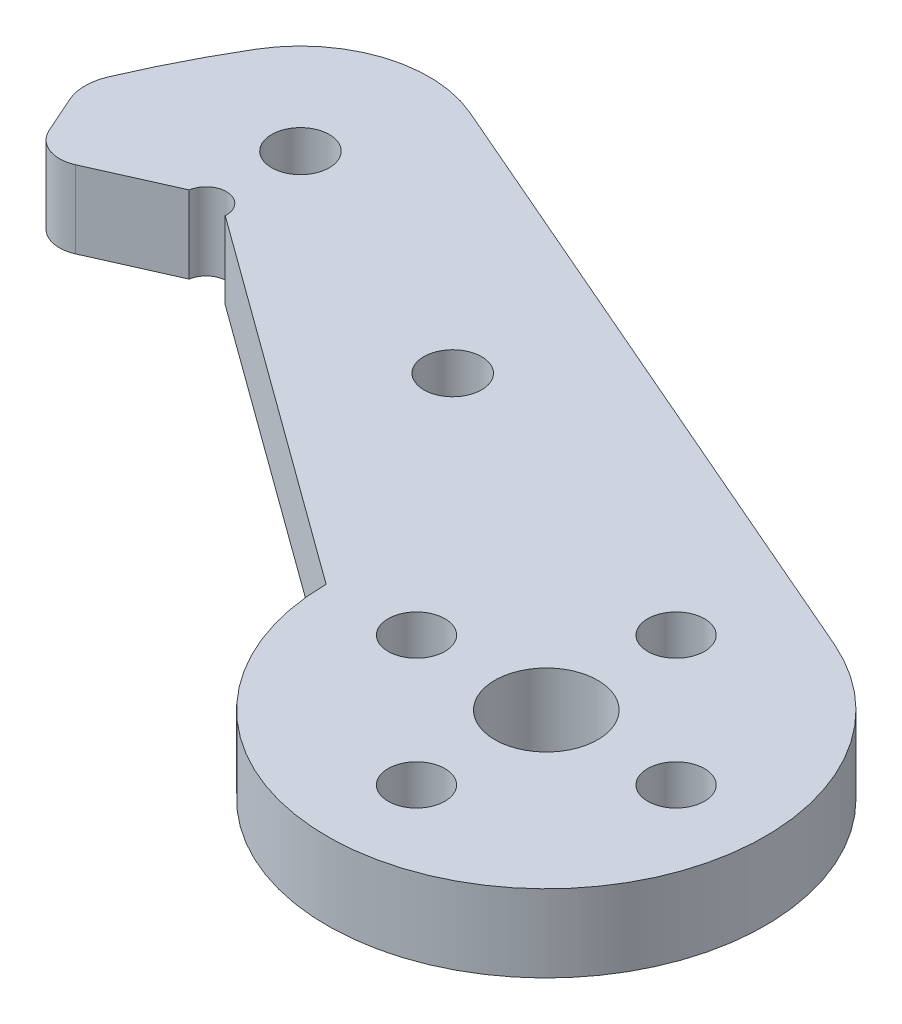
ISO-10303-21;
HEADER;
FILE_DESCRIPTION(('STEP AP214'),'2;1');
FILE_NAME('part.step','',(''),(''),'','','');
FILE_SCHEMA(('AUTOMOTIVE_DESIGN { 1 0 10303 214 1 1 1 1 }'));
ENDSEC;
DATA;
#1=APPLICATION_CONTEXT('core data for automotive mechanical design processes');
#2=APPLICATION_PROTOCOL_DEFINITION('international standard','automotive_design',2000,#1);
#3=PRODUCT_CONTEXT('',#1,'mechanical');
#4=PRODUCT('Part','Part','',(#3));
#5=PRODUCT_RELATED_PRODUCT_CATEGORY('part','',(#4));
#6=PRODUCT_DEFINITION_FORMATION('','',#4);
#7=PRODUCT_DEFINITION_CONTEXT('part definition',#1,'design');
#8=PRODUCT_DEFINITION('design','',#6,#7);
#9=PRODUCT_DEFINITION_SHAPE('','',#8);
#10=(LENGTH_UNIT() NAMED_UNIT(*) SI_UNIT(.MILLI.,.METRE.));
#11=(NAMED_UNIT(*) PLANE_ANGLE_UNIT() SI_UNIT($,.RADIAN.));
#12=(NAMED_UNIT(*) SI_UNIT($,.STERADIAN.) SOLID_ANGLE_UNIT());
#13=UNCERTAINTY_MEASURE_WITH_UNIT(LENGTH_MEASURE(1.E-05),#10,'distance_accuracy_value','');
#14=(GEOMETRIC_REPRESENTATION_CONTEXT(3) GLOBAL_UNCERTAINTY_ASSIGNED_CONTEXT((#13)) GLOBAL_UNIT_ASSIGNED_CONTEXT((#10,
#11,#12)) REPRESENTATION_CONTEXT('',''));
#15=CARTESIAN_POINT('',(0.,0.,0.));
#16=DIRECTION('',(0.,0.,1.));
#17=DIRECTION('',(1.,0.,0.));
#18=AXIS2_PLACEMENT_3D('',#15,#16,#17);
#19=CARTESIAN_POINT('',(-44.4381463641511,4.7625,-16.4261833639371));
#20=DIRECTION('',(0.,-1.,0.));
#21=DIRECTION('',(0.,0.,-1.));
#22=AXIS2_PLACEMENT_3D('',#19,#20,#21);
#23=PLANE('',#22);
#24=CARTESIAN_POINT('',(-44.4381463641511,4.7625,-16.4261833639371));
#25=DIRECTION('',(0.,1.,0.));
#26=DIRECTION('',(0.,0.,-1.));
#27=AXIS2_PLACEMENT_3D('',#24,#25,#26);
#28=CIRCLE('',#27,2.);
#29=CARTESIAN_POINT('',(-46.2655823530906,4.7625,-15.6134855687334));
#30=VERTEX_POINT('',#29);
#31=CARTESIAN_POINT('',(-43.6254485689475,4.7625,-14.5987473749976));
#32=VERTEX_POINT('',#31);
#33=EDGE_CURVE('E171',#30,#32,#28,.T.);
#34=ORIENTED_EDGE('',*,*,#33,.T.);
#35=DIRECTION('',(0.913717994469729,0.,-0.406348897601823));
#36=VECTOR('',#35,1.);
#37=CARTESIAN_POINT('',(-38.7702250311405,4.7625,-16.7579636147339));
#38=LINE('',#37,#36);
#39=CARTESIAN_POINT('',(-38.7702250311405,4.7625,-16.7579636147339));
#40=VERTEX_POINT('',#39);
#41=EDGE_CURVE('E109',#32,#40,#38,.T.);
#42=ORIENTED_EDGE('',*,*,#41,.T.);
#43=CARTESIAN_POINT('',(-37.5347907026087,4.7625,-16.5676953307629));
#44=DIRECTION('',(0.,-1.,0.));
#45=DIRECTION('',(0.,0.,-1.));
#46=AXIS2_PLACEMENT_3D('',#43,#44,#45);
#47=CIRCLE('',#46,1.25);
#48=CARTESIAN_POINT('',(-36.2868550805044,4.7625,-16.4958852821415));
#49=VERTEX_POINT('',#48);
#50=EDGE_CURVE('E192',#40,#49,#47,.T.);
#51=ORIENTED_EDGE('',*,*,#50,.T.);
#52=DIRECTION('',(0.808767465357848,0.,0.588128546304839));
#53=VECTOR('',#52,1.);
#54=CARTESIAN_POINT('',(-36.2868550805044,4.7625,-16.4958852821415));
#55=LINE('',#54,#53);
#56=CARTESIAN_POINT('',(-13.4997935259034,4.7625,0.0746643018933128));
#57=VERTEX_POINT('',#56);
#58=EDGE_CURVE('E211',#49,#57,#55,.T.);
#59=ORIENTED_EDGE('',*,*,#58,.T.);
#60=CARTESIAN_POINT('',(0.,4.7625,0.));
#61=DIRECTION('',(0.,1.,0.));
#62=DIRECTION('',(0.,0.,1.));
#63=AXIS2_PLACEMENT_3D('',#60,#61,#62);
#64=CIRCLE('',#63,13.5);
#65=CARTESIAN_POINT('',(5.36363887672502,4.7625,-12.3887601478148));
#66=VERTEX_POINT('',#65);
#67=EDGE_CURVE('E208',#57,#66,#64,.T.);
#68=ORIENTED_EDGE('',*,*,#67,.T.);
#69=DIRECTION('',(-0.91768593687517,0.,-0.397306583461113));
#70=VECTOR('',#69,1.);
#71=CARTESIAN_POINT('',(-34.2596328863461,4.7625,-29.5434163293646));
#72=LINE('',#71,#70);
#73=CARTESIAN_POINT('',(-34.2596328863461,4.7625,-29.5434163293646));
#74=VERTEX_POINT('',#73);
#75=EDGE_CURVE('E210',#66,#74,#72,.T.);
#76=ORIENTED_EDGE('',*,*,#75,.T.);
#77=CARTESIAN_POINT('',(-37.4132538925687,4.7625,-22.2592842054179));
#78=DIRECTION('',(0.,1.,0.));
#79=DIRECTION('',(0.,0.,1.));
#80=AXIS2_PLACEMENT_3D('',#77,#78,#79);
#81=CIRCLE('',#80,7.93750000000001);
#82=CARTESIAN_POINT('',(-44.234733224639,4.7625,-26.3177723441387));
#83=VERTEX_POINT('',#82);
#84=EDGE_CURVE('E134',#74,#83,#81,.T.);
#85=ORIENTED_EDGE('',*,*,#84,.T.);
#86=CARTESIAN_POINT('',(0.,4.7625,0.));
#87=DIRECTION('',(0.,1.,0.));
#88=DIRECTION('',(0.,0.,-1.));
#89=AXIS2_PLACEMENT_3D('',#86,#87,#88);
#90=CIRCLE('',#89,51.4717083902691);
#91=CARTESIAN_POINT('',(-47.2982832858306,4.7625,-20.3029348328316));
#92=VERTEX_POINT('',#91);
#93=EDGE_CURVE('E128',#83,#92,#90,.T.);
#94=ORIENTED_EDGE('',*,*,#93,.T.);
#95=CARTESIAN_POINT('',(-44.5415290553004,4.7625,-19.1195895271606));
#96=DIRECTION('',(0.,1.,0.));
#97=DIRECTION('',(0.,0.,1.));
#98=AXIS2_PLACEMENT_3D('',#95,#96,#97);
#99=CIRCLE('',#98,3.);
#100=CARTESIAN_POINT('',(-47.2826830387096,4.7625,-17.9005428343551));
#101=VERTEX_POINT('',#100);
#102=EDGE_CURVE('E132',#92,#101,#99,.T.);
#103=ORIENTED_EDGE('',*,*,#102,.T.);
#104=DIRECTION('',(0.406348897601823,0.,0.913717994469729));
#105=VECTOR('',#104,1.);
#106=CARTESIAN_POINT('',(-46.2655823530906,4.7625,-15.6134855687334));
#107=LINE('',#106,#105);
#108=EDGE_CURVE('E60',#101,#30,#107,.T.);
#109=ORIENTED_EDGE('',*,*,#108,.T.);
#110=EDGE_LOOP('',(#34,#42,#51,#59,#68,#76,#85,#94,#103,#109));
#111=FACE_BOUND('',#110,.T.);
#112=CARTESIAN_POINT('',(-20.8624589223986,4.7625,-15.0937174914343));
#113=DIRECTION('',(0.,1.,0.));
#114=DIRECTION('',(0.,0.,1.));
#115=AXIS2_PLACEMENT_3D('',#112,#113,#114);
#116=CIRCLE('',#115,1.778);
#117=CARTESIAN_POINT('',(-20.8624589223986,4.7625,-13.3157174914343));
#118=VERTEX_POINT('',#117);
#119=EDGE_CURVE('E156',#118,#118,#116,.T.);
#120=ORIENTED_EDGE('',*,*,#119,.F.);
#121=EDGE_LOOP('',(#120));
#122=FACE_BOUND('',#121,.T.);
#123=CARTESIAN_POINT('',(8.,4.7625,0.));
#124=DIRECTION('',(0.,1.,0.));
#125=DIRECTION('',(0.,0.,1.));
#126=AXIS2_PLACEMENT_3D('',#123,#124,#125);
#127=CIRCLE('',#126,1.75);
#128=CARTESIAN_POINT('',(8.,4.7625,1.75));
#129=VERTEX_POINT('',#128);
#130=EDGE_CURVE('E222',#129,#129,#127,.T.);
#131=ORIENTED_EDGE('',*,*,#130,.F.);
#132=EDGE_LOOP('',(#131));
#133=FACE_BOUND('',#132,.T.);
#134=CARTESIAN_POINT('',(0.,4.7625,8.));
#135=DIRECTION('',(0.,1.,0.));
#136=DIRECTION('',(0.,0.,1.));
#137=AXIS2_PLACEMENT_3D('',#134,#135,#136);
#138=CIRCLE('',#137,1.75);
#139=CARTESIAN_POINT('',(0.,4.7625,9.75));
#140=VERTEX_POINT('',#139);
#141=EDGE_CURVE('E228',#140,#140,#138,.T.);
#142=ORIENTED_EDGE('',*,*,#141,.F.);
#143=EDGE_LOOP('',(#142));
#144=FACE_BOUND('',#143,.T.);
#145=CARTESIAN_POINT('',(-8.,4.7625,0.));
#146=DIRECTION('',(0.,1.,0.));
#147=DIRECTION('',(0.,0.,1.));
#148=AXIS2_PLACEMENT_3D('',#145,#146,#147);
#149=CIRCLE('',#148,1.75);
#150=CARTESIAN_POINT('',(-8.,4.7625,1.75));
#151=VERTEX_POINT('',#150);
#152=EDGE_CURVE('E234',#151,#151,#149,.T.);
#153=ORIENTED_EDGE('',*,*,#152,.F.);
#154=EDGE_LOOP('',(#153));
#155=FACE_BOUND('',#154,.T.);
#156=CARTESIAN_POINT('',(0.,4.7625,-8.));
#157=DIRECTION('',(0.,1.,0.));
#158=DIRECTION('',(0.,0.,1.));
#159=AXIS2_PLACEMENT_3D('',#156,#157,#158);
#160=CIRCLE('',#159,1.75);
#161=CARTESIAN_POINT('',(0.,4.7625,-6.25));
#162=VERTEX_POINT('',#161);
#163=EDGE_CURVE('E240',#162,#162,#160,.T.);
#164=ORIENTED_EDGE('',*,*,#163,.F.);
#165=EDGE_LOOP('',(#164));
#166=FACE_BOUND('',#165,.T.);
#167=CARTESIAN_POINT('',(0.,4.7625,0.));
#168=DIRECTION('',(0.,1.,0.));
#169=DIRECTION('',(0.,0.,1.));
#170=AXIS2_PLACEMENT_3D('',#167,#168,#169);
#171=CIRCLE('',#170,3.175);
#172=CARTESIAN_POINT('',(0.,4.7625,3.175));
#173=VERTEX_POINT('',#172);
#174=EDGE_CURVE('E246',#173,#173,#171,.T.);
#175=ORIENTED_EDGE('',*,*,#174,.F.);
#176=EDGE_LOOP('',(#175));
#177=FACE_BOUND('',#176,.T.);
#178=CARTESIAN_POINT('',(-37.4132538925687,4.7625,-22.2592842054179));
#179=DIRECTION('',(0.,1.,0.));
#180=DIRECTION('',(0.,0.,1.));
#181=AXIS2_PLACEMENT_3D('',#178,#179,#180);
#182=CIRCLE('',#181,1.778);
#183=CARTESIAN_POINT('',(-37.4132538925687,4.7625,-20.4812842054179));
#184=VERTEX_POINT('',#183);
#185=EDGE_CURVE('E252',#184,#184,#182,.T.);
#186=ORIENTED_EDGE('',*,*,#185,.F.);
#187=EDGE_LOOP('',(#186));
#188=FACE_BOUND('',#187,.T.);
#189=ADVANCED_FACE('F43',(#111,#122,#133,#144,#155,#166,#177,#188),#23,.F.);
#190=CARTESIAN_POINT('',(-44.4381463641511,0.,-16.4261833639371));
#191=DIRECTION('',(0.,-1.,0.));
#192=DIRECTION('',(0.,0.,-1.));
#193=AXIS2_PLACEMENT_3D('',#190,#191,#192);
#194=PLANE('',#193);
#195=CARTESIAN_POINT('',(0.,0.,0.));
#196=DIRECTION('',(0.,1.,0.));
#197=DIRECTION('',(0.,0.,1.));
#198=AXIS2_PLACEMENT_3D('',#195,#196,#197);
#199=CIRCLE('',#198,3.175);
#200=CARTESIAN_POINT('',(0.,0.,3.175));
#201=VERTEX_POINT('',#200);
#202=EDGE_CURVE('E249',#201,#201,#199,.T.);
#203=ORIENTED_EDGE('',*,*,#202,.T.);
#204=EDGE_LOOP('',(#203));
#205=FACE_BOUND('',#204,.T.);
#206=CARTESIAN_POINT('',(-8.,0.,0.));
#207=DIRECTION('',(0.,1.,0.));
#208=DIRECTION('',(0.,0.,1.));
#209=AXIS2_PLACEMENT_3D('',#206,#207,#208);
#210=CIRCLE('',#209,1.75);
#211=CARTESIAN_POINT('',(-8.,0.,1.75));
#212=VERTEX_POINT('',#211);
#213=EDGE_CURVE('E237',#212,#212,#210,.T.);
#214=ORIENTED_EDGE('',*,*,#213,.T.);
#215=EDGE_LOOP('',(#214));
#216=FACE_BOUND('',#215,.T.);
#217=CARTESIAN_POINT('',(8.,0.,0.));
#218=DIRECTION('',(0.,1.,0.));
#219=DIRECTION('',(0.,0.,1.));
#220=AXIS2_PLACEMENT_3D('',#217,#218,#219);
#221=CIRCLE('',#220,1.75);
#222=CARTESIAN_POINT('',(8.,0.,1.75));
#223=VERTEX_POINT('',#222);
#224=EDGE_CURVE('E225',#223,#223,#221,.T.);
#225=ORIENTED_EDGE('',*,*,#224,.T.);
#226=EDGE_LOOP('',(#225));
#227=FACE_BOUND('',#226,.T.);
#228=CARTESIAN_POINT('',(-44.4381463641511,0.,-16.4261833639371));
#229=DIRECTION('',(0.,1.,0.));
#230=DIRECTION('',(0.,0.,-1.));
#231=AXIS2_PLACEMENT_3D('',#228,#229,#230);
#232=CIRCLE('',#231,2.);
#233=CARTESIAN_POINT('',(-46.2655823530906,0.,-15.6134855687334));
#234=VERTEX_POINT('',#233);
#235=CARTESIAN_POINT('',(-43.6254485689475,0.,-14.5987473749976));
#236=VERTEX_POINT('',#235);
#237=EDGE_CURVE('E152',#234,#236,#232,.T.);
#238=ORIENTED_EDGE('',*,*,#237,.F.);
#239=DIRECTION('',(0.406348897601823,0.,0.913717994469729));
#240=VECTOR('',#239,1.);
#241=CARTESIAN_POINT('',(-46.2655823530906,0.,-15.6134855687334));
#242=LINE('',#241,#240);
#243=CARTESIAN_POINT('',(-47.2826830387096,0.,-17.9005428343551));
#244=VERTEX_POINT('',#243);
#245=EDGE_CURVE('E101',#244,#234,#242,.T.);
#246=ORIENTED_EDGE('',*,*,#245,.F.);
#247=CARTESIAN_POINT('',(-44.5415290553004,0.,-19.1195895271606));
#248=DIRECTION('',(0.,1.,0.));
#249=DIRECTION('',(0.,0.,1.));
#250=AXIS2_PLACEMENT_3D('',#247,#248,#249);
#251=CIRCLE('',#250,3.);
#252=CARTESIAN_POINT('',(-47.2982832858306,0.,-20.3029348328316));
#253=VERTEX_POINT('',#252);
#254=EDGE_CURVE('E95',#253,#244,#251,.T.);
#255=ORIENTED_EDGE('',*,*,#254,.F.);
#256=CARTESIAN_POINT('',(0.,0.,0.));
#257=DIRECTION('',(0.,1.,0.));
#258=DIRECTION('',(0.,0.,-1.));
#259=AXIS2_PLACEMENT_3D('',#256,#257,#258);
#260=CIRCLE('',#259,51.4717083902691);
#261=CARTESIAN_POINT('',(-44.234733224639,0.,-26.3177723441387));
#262=VERTEX_POINT('',#261);
#263=EDGE_CURVE('E142',#262,#253,#260,.T.);
#264=ORIENTED_EDGE('',*,*,#263,.F.);
#265=CARTESIAN_POINT('',(-37.4132538925687,0.,-22.2592842054179));
#266=DIRECTION('',(0.,1.,0.));
#267=DIRECTION('',(0.,0.,1.));
#268=AXIS2_PLACEMENT_3D('',#265,#266,#267);
#269=CIRCLE('',#268,7.93750000000001);
#270=CARTESIAN_POINT('',(-34.2596328863461,0.,-29.5434163293646));
#271=VERTEX_POINT('',#270);
#272=EDGE_CURVE('E166',#271,#262,#269,.T.);
#273=ORIENTED_EDGE('',*,*,#272,.F.);
#274=DIRECTION('',(-0.91768593687517,0.,-0.397306583461113));
#275=VECTOR('',#274,1.);
#276=CARTESIAN_POINT('',(-34.2596328863461,0.,-29.5434163293646));
#277=LINE('',#276,#275);
#278=CARTESIAN_POINT('',(5.36363887672502,0.,-12.3887601478148));
#279=VERTEX_POINT('',#278);
#280=EDGE_CURVE('E164',#279,#271,#277,.T.);
#281=ORIENTED_EDGE('',*,*,#280,.F.);
#282=CARTESIAN_POINT('',(0.,0.,0.));
#283=DIRECTION('',(0.,1.,0.));
#284=DIRECTION('',(0.,0.,1.));
#285=AXIS2_PLACEMENT_3D('',#282,#283,#284);
#286=CIRCLE('',#285,13.5);
#287=CARTESIAN_POINT('',(-13.4997935259034,0.,0.0746643018933128));
#288=VERTEX_POINT('',#287);
#289=EDGE_CURVE('E162',#288,#279,#286,.T.);
#290=ORIENTED_EDGE('',*,*,#289,.F.);
#291=DIRECTION('',(0.808767465357848,0.,0.588128546304839));
#292=VECTOR('',#291,1.);
#293=CARTESIAN_POINT('',(-36.2868550805044,0.,-16.4958852821415));
#294=LINE('',#293,#292);
#295=CARTESIAN_POINT('',(-36.2868550805044,0.,-16.4958852821415));
#296=VERTEX_POINT('',#295);
#297=EDGE_CURVE('E160',#296,#288,#294,.T.);
#298=ORIENTED_EDGE('',*,*,#297,.F.);
#299=CARTESIAN_POINT('',(-37.5347907026087,0.,-16.5676953307629));
#300=DIRECTION('',(0.,-1.,0.));
#301=DIRECTION('',(0.,0.,-1.));
#302=AXIS2_PLACEMENT_3D('',#299,#300,#301);
#303=CIRCLE('',#302,1.25);
#304=CARTESIAN_POINT('',(-38.7702250311405,0.,-16.7579636147339));
#305=VERTEX_POINT('',#304);
#306=EDGE_CURVE('E158',#305,#296,#303,.T.);
#307=ORIENTED_EDGE('',*,*,#306,.F.);
#308=DIRECTION('',(0.913717994469729,0.,-0.406348897601823));
#309=VECTOR('',#308,1.);
#310=CARTESIAN_POINT('',(-38.7702250311405,0.,-16.7579636147339));
#311=LINE('',#310,#309);
#312=EDGE_CURVE('E155',#236,#305,#311,.T.);
#313=ORIENTED_EDGE('',*,*,#312,.F.);
#314=EDGE_LOOP('',(#238,#246,#255,#264,#273,#281,#290,#298,#307,#313));
#315=FACE_BOUND('',#314,.T.);
#316=CARTESIAN_POINT('',(-20.8624589223986,0.,-15.0937174914343));
#317=DIRECTION('',(0.,1.,0.));
#318=DIRECTION('',(0.,0.,1.));
#319=AXIS2_PLACEMENT_3D('',#316,#317,#318);
#320=CIRCLE('',#319,1.778);
#321=CARTESIAN_POINT('',(-20.8624589223986,0.,-13.3157174914343));
#322=VERTEX_POINT('',#321);
#323=EDGE_CURVE('E219',#322,#322,#320,.T.);
#324=ORIENTED_EDGE('',*,*,#323,.T.);
#325=EDGE_LOOP('',(#324));
#326=FACE_BOUND('',#325,.T.);
#327=CARTESIAN_POINT('',(0.,0.,8.));
#328=DIRECTION('',(0.,1.,0.));
#329=DIRECTION('',(0.,0.,1.));
#330=AXIS2_PLACEMENT_3D('',#327,#328,#329);
#331=CIRCLE('',#330,1.75);
#332=CARTESIAN_POINT('',(0.,0.,9.75));
#333=VERTEX_POINT('',#332);
#334=EDGE_CURVE('E231',#333,#333,#331,.T.);
#335=ORIENTED_EDGE('',*,*,#334,.T.);
#336=EDGE_LOOP('',(#335));
#337=FACE_BOUND('',#336,.T.);
#338=CARTESIAN_POINT('',(0.,0.,-8.));
#339=DIRECTION('',(0.,1.,0.));
#340=DIRECTION('',(0.,0.,1.));
#341=AXIS2_PLACEMENT_3D('',#338,#339,#340);
#342=CIRCLE('',#341,1.75);
#343=CARTESIAN_POINT('',(0.,0.,-6.25));
#344=VERTEX_POINT('',#343);
#345=EDGE_CURVE('E243',#344,#344,#342,.T.);
#346=ORIENTED_EDGE('',*,*,#345,.T.);
#347=EDGE_LOOP('',(#346));
#348=FACE_BOUND('',#347,.T.);
#349=CARTESIAN_POINT('',(-37.4132538925687,0.,-22.2592842054179));
#350=DIRECTION('',(0.,1.,0.));
#351=DIRECTION('',(0.,0.,1.));
#352=AXIS2_PLACEMENT_3D('',#349,#350,#351);
#353=CIRCLE('',#352,1.778);
#354=CARTESIAN_POINT('',(-37.4132538925687,0.,-20.4812842054179));
#355=VERTEX_POINT('',#354);
#356=EDGE_CURVE('E255',#355,#355,#353,.T.);
#357=ORIENTED_EDGE('',*,*,#356,.T.);
#358=EDGE_LOOP('',(#357));
#359=FACE_BOUND('',#358,.T.);
#360=ADVANCED_FACE('F196',(#205,#216,#227,#315,#326,#337,#348,#359),#194,.T.);
#361=CARTESIAN_POINT('',(-44.4381463641511,4.7625,-16.4261833639371));
#362=DIRECTION('',(0.,-1.,0.));
#363=DIRECTION('',(0.,0.,-1.));
#364=AXIS2_PLACEMENT_3D('',#361,#362,#363);
#365=CYLINDRICAL_SURFACE('',#364,2.);
#366=ORIENTED_EDGE('',*,*,#237,.T.);
#367=DIRECTION('',(0.,-1.,0.));
#368=VECTOR('',#367,1.);
#369=CARTESIAN_POINT('',(-43.6254485689475,4.7625,-14.5987473749976));
#370=LINE('',#369,#368);
#371=EDGE_CURVE('E13',#32,#236,#370,.T.);
#372=ORIENTED_EDGE('',*,*,#371,.F.);
#373=ORIENTED_EDGE('',*,*,#33,.F.);
#374=DIRECTION('',(0.,-1.,0.));
#375=VECTOR('',#374,1.);
#376=CARTESIAN_POINT('',(-46.2655823530906,4.7625,-15.6134855687334));
#377=LINE('',#376,#375);
#378=EDGE_CURVE('E148',#30,#234,#377,.T.);
#379=ORIENTED_EDGE('',*,*,#378,.T.);
#380=EDGE_LOOP('',(#366,#372,#373,#379));
#381=FACE_BOUND('',#380,.T.);
#382=ADVANCED_FACE('F45',(#381),#365,.T.);
#383=CARTESIAN_POINT('',(-38.7702250311405,4.7625,-16.7579636147339));
#384=DIRECTION('',(-0.406348897601823,0.,-0.913717994469729));
#385=DIRECTION('',(-0.913717994469729,0.,0.406348897601823));
#386=AXIS2_PLACEMENT_3D('',#383,#384,#385);
#387=PLANE('',#386);
#388=ORIENTED_EDGE('',*,*,#312,.T.);
#389=DIRECTION('',(0.,-1.,0.));
#390=VECTOR('',#389,1.);
#391=CARTESIAN_POINT('',(-38.7702250311405,4.7625,-16.7579636147339));
#392=LINE('',#391,#390);
#393=EDGE_CURVE('E52',#40,#305,#392,.T.);
#394=ORIENTED_EDGE('',*,*,#393,.F.);
#395=ORIENTED_EDGE('',*,*,#41,.F.);
#396=ORIENTED_EDGE('',*,*,#371,.T.);
#397=EDGE_LOOP('',(#388,#394,#395,#396));
#398=FACE_BOUND('',#397,.T.);
#399=ADVANCED_FACE('F295',(#398),#387,.F.);
#400=CARTESIAN_POINT('',(-37.5347907026087,4.7625,-16.5676953307629));
#401=DIRECTION('',(0.,-1.,0.));
#402=DIRECTION('',(0.,0.,-1.));
#403=AXIS2_PLACEMENT_3D('',#400,#401,#402);
#404=CYLINDRICAL_SURFACE('',#403,1.25);
#405=ORIENTED_EDGE('',*,*,#306,.T.);
#406=DIRECTION('',(0.,-1.,0.));
#407=VECTOR('',#406,1.);
#408=CARTESIAN_POINT('',(-36.2868550805044,4.7625,-16.4958852821415));
#409=LINE('',#408,#407);
#410=EDGE_CURVE('E184',#49,#296,#409,.T.);
#411=ORIENTED_EDGE('',*,*,#410,.F.);
#412=ORIENTED_EDGE('',*,*,#50,.F.);
#413=ORIENTED_EDGE('',*,*,#393,.T.);
#414=EDGE_LOOP('',(#405,#411,#412,#413));
#415=FACE_BOUND('',#414,.T.);
#416=ADVANCED_FACE('F190',(#415),#404,.F.);
#417=CARTESIAN_POINT('',(-36.2868550805044,4.7625,-16.4958852821415));
#418=DIRECTION('',(0.588128546304839,0.,-0.808767465357848));
#419=DIRECTION('',(-0.808767465357848,0.,-0.588128546304839));
#420=AXIS2_PLACEMENT_3D('',#417,#418,#419);
#421=PLANE('',#420);
#422=ORIENTED_EDGE('',*,*,#297,.T.);
#423=DIRECTION('',(0.,-1.,0.));
#424=VECTOR('',#423,1.);
#425=CARTESIAN_POINT('',(-13.4997935259034,4.7625,0.0746643018933128));
#426=LINE('',#425,#424);
#427=EDGE_CURVE('E181',#57,#288,#426,.T.);
#428=ORIENTED_EDGE('',*,*,#427,.F.);
#429=ORIENTED_EDGE('',*,*,#58,.F.);
#430=ORIENTED_EDGE('',*,*,#410,.T.);
#431=EDGE_LOOP('',(#422,#428,#429,#430));
#432=FACE_BOUND('',#431,.T.);
#433=ADVANCED_FACE('F202',(#432),#421,.F.);
#434=CARTESIAN_POINT('',(0.,4.7625,0.));
#435=DIRECTION('',(0.,-1.,0.));
#436=DIRECTION('',(0.,0.,-1.));
#437=AXIS2_PLACEMENT_3D('',#434,#435,#436);
#438=CYLINDRICAL_SURFACE('',#437,13.5);
#439=ORIENTED_EDGE('',*,*,#289,.T.);
#440=DIRECTION('',(0.,-1.,0.));
#441=VECTOR('',#440,1.);
#442=CARTESIAN_POINT('',(5.36363887672502,4.7625,-12.3887601478148));
#443=LINE('',#442,#441);
#444=EDGE_CURVE('E178',#66,#279,#443,.T.);
#445=ORIENTED_EDGE('',*,*,#444,.F.);
#446=ORIENTED_EDGE('',*,*,#67,.F.);
#447=ORIENTED_EDGE('',*,*,#427,.T.);
#448=EDGE_LOOP('',(#439,#445,#446,#447));
#449=FACE_BOUND('',#448,.T.);
#450=ADVANCED_FACE('F206',(#449),#438,.T.);
#451=CARTESIAN_POINT('',(-34.2596328863461,4.7625,-29.5434163293646));
#452=DIRECTION('',(-0.397306583461113,0.,0.91768593687517));
#453=DIRECTION('',(0.91768593687517,0.,0.397306583461113));
#454=AXIS2_PLACEMENT_3D('',#451,#452,#453);
#455=PLANE('',#454);
#456=ORIENTED_EDGE('',*,*,#280,.T.);
#457=DIRECTION('',(0.,-1.,0.));
#458=VECTOR('',#457,1.);
#459=CARTESIAN_POINT('',(-34.2596328863461,4.7625,-29.5434163293646));
#460=LINE('',#459,#458);
#461=EDGE_CURVE('E175',#74,#271,#460,.T.);
#462=ORIENTED_EDGE('',*,*,#461,.F.);
#463=ORIENTED_EDGE('',*,*,#75,.F.);
#464=ORIENTED_EDGE('',*,*,#444,.T.);
#465=EDGE_LOOP('',(#456,#462,#463,#464));
#466=FACE_BOUND('',#465,.T.);
#467=ADVANCED_FACE('F285',(#466),#455,.F.);
#468=CARTESIAN_POINT('',(-37.4132538925687,4.7625,-22.2592842054179));
#469=DIRECTION('',(0.,-1.,0.));
#470=DIRECTION('',(0.,0.,-1.));
#471=AXIS2_PLACEMENT_3D('',#468,#469,#470);
#472=CYLINDRICAL_SURFACE('',#471,7.93750000000001);
#473=ORIENTED_EDGE('',*,*,#272,.T.);
#474=DIRECTION('',(0.,-1.,0.));
#475=VECTOR('',#474,1.);
#476=CARTESIAN_POINT('',(-44.234733224639,4.7625,-26.3177723441387));
#477=LINE('',#476,#475);
#478=EDGE_CURVE('E143',#83,#262,#477,.T.);
#479=ORIENTED_EDGE('',*,*,#478,.F.);
#480=ORIENTED_EDGE('',*,*,#84,.F.);
#481=ORIENTED_EDGE('',*,*,#461,.T.);
#482=EDGE_LOOP('',(#473,#479,#480,#481));
#483=FACE_BOUND('',#482,.T.);
#484=ADVANCED_FACE('F282',(#483),#472,.T.);
#485=CARTESIAN_POINT('',(0.,4.7625,0.));
#486=DIRECTION('',(0.,-1.,0.));
#487=DIRECTION('',(0.,0.,-1.));
#488=AXIS2_PLACEMENT_3D('',#485,#486,#487);
#489=CYLINDRICAL_SURFACE('',#488,51.4717083902691);
#490=ORIENTED_EDGE('',*,*,#263,.T.);
#491=DIRECTION('',(0.,-1.,0.));
#492=VECTOR('',#491,1.);
#493=CARTESIAN_POINT('',(-47.2982832858306,4.7625,-20.3029348328316));
#494=LINE('',#493,#492);
#495=EDGE_CURVE('E139',#92,#253,#494,.T.);
#496=ORIENTED_EDGE('',*,*,#495,.F.);
#497=ORIENTED_EDGE('',*,*,#93,.F.);
#498=ORIENTED_EDGE('',*,*,#478,.T.);
#499=EDGE_LOOP('',(#490,#496,#497,#498));
#500=FACE_BOUND('',#499,.T.);
#501=ADVANCED_FACE('F140',(#500),#489,.T.);
#502=CARTESIAN_POINT('',(-44.5415290553004,4.7625,-19.1195895271606));
#503=DIRECTION('',(0.,-1.,0.));
#504=DIRECTION('',(0.,0.,-1.));
#505=AXIS2_PLACEMENT_3D('',#502,#503,#504);
#506=CYLINDRICAL_SURFACE('',#505,3.);
#507=ORIENTED_EDGE('',*,*,#254,.T.);
#508=DIRECTION('',(0.,-1.,0.));
#509=VECTOR('',#508,1.);
#510=CARTESIAN_POINT('',(-47.2826830387096,4.7625,-17.9005428343551));
#511=LINE('',#510,#509);
#512=EDGE_CURVE('E144',#101,#244,#511,.T.);
#513=ORIENTED_EDGE('',*,*,#512,.F.);
#514=ORIENTED_EDGE('',*,*,#102,.F.);
#515=ORIENTED_EDGE('',*,*,#495,.T.);
#516=EDGE_LOOP('',(#507,#513,#514,#515));
#517=FACE_BOUND('',#516,.T.);
#518=ADVANCED_FACE('F146',(#517),#506,.T.);
#519=CARTESIAN_POINT('',(-46.2655823530906,4.7625,-15.6134855687334));
#520=DIRECTION('',(0.913717994469729,0.,-0.406348897601823));
#521=DIRECTION('',(-0.406348897601823,0.,-0.913717994469729));
#522=AXIS2_PLACEMENT_3D('',#519,#520,#521);
#523=PLANE('',#522);
#524=ORIENTED_EDGE('',*,*,#245,.T.);
#525=ORIENTED_EDGE('',*,*,#378,.F.);
#526=ORIENTED_EDGE('',*,*,#108,.F.);
#527=ORIENTED_EDGE('',*,*,#512,.T.);
#528=EDGE_LOOP('',(#524,#525,#526,#527));
#529=FACE_BOUND('',#528,.T.);
#530=ADVANCED_FACE('F275',(#529),#523,.F.);
#531=CARTESIAN_POINT('',(-20.8624589223986,4.7625,-15.0937174914343));
#532=DIRECTION('',(0.,-1.,0.));
#533=DIRECTION('',(0.,0.,-1.));
#534=AXIS2_PLACEMENT_3D('',#531,#532,#533);
#535=CYLINDRICAL_SURFACE('',#534,1.778);
#536=ORIENTED_EDGE('',*,*,#119,.T.);
#537=EDGE_LOOP('',(#536));
#538=FACE_BOUND('',#537,.T.);
#539=ORIENTED_EDGE('',*,*,#323,.F.);
#540=EDGE_LOOP('',(#539));
#541=FACE_BOUND('',#540,.T.);
#542=ADVANCED_FACE('F272',(#538,#541),#535,.F.);
#543=CARTESIAN_POINT('',(8.,4.7625,0.));
#544=DIRECTION('',(0.,-1.,0.));
#545=DIRECTION('',(0.,0.,-1.));
#546=AXIS2_PLACEMENT_3D('',#543,#544,#545);
#547=CYLINDRICAL_SURFACE('',#546,1.75);
#548=ORIENTED_EDGE('',*,*,#130,.T.);
#549=EDGE_LOOP('',(#548));
#550=FACE_BOUND('',#549,.T.);
#551=ORIENTED_EDGE('',*,*,#224,.F.);
#552=EDGE_LOOP('',(#551));
#553=FACE_BOUND('',#552,.T.);
#554=ADVANCED_FACE('F371',(#550,#553),#547,.F.);
#555=CARTESIAN_POINT('',(0.,4.7625,8.));
#556=DIRECTION('',(0.,-1.,0.));
#557=DIRECTION('',(0.,0.,-1.));
#558=AXIS2_PLACEMENT_3D('',#555,#556,#557);
#559=CYLINDRICAL_SURFACE('',#558,1.75);
#560=ORIENTED_EDGE('',*,*,#141,.T.);
#561=EDGE_LOOP('',(#560));
#562=FACE_BOUND('',#561,.T.);
#563=ORIENTED_EDGE('',*,*,#334,.F.);
#564=EDGE_LOOP('',(#563));
#565=FACE_BOUND('',#564,.T.);
#566=ADVANCED_FACE('F379',(#562,#565),#559,.F.);
#567=CARTESIAN_POINT('',(-8.,4.7625,0.));
#568=DIRECTION('',(0.,-1.,0.));
#569=DIRECTION('',(0.,0.,-1.));
#570=AXIS2_PLACEMENT_3D('',#567,#568,#569);
#571=CYLINDRICAL_SURFACE('',#570,1.75);
#572=ORIENTED_EDGE('',*,*,#152,.T.);
#573=EDGE_LOOP('',(#572));
#574=FACE_BOUND('',#573,.T.);
#575=ORIENTED_EDGE('',*,*,#213,.F.);
#576=EDGE_LOOP('',(#575));
#577=FACE_BOUND('',#576,.T.);
#578=ADVANCED_FACE('F387',(#574,#577),#571,.F.);
#579=CARTESIAN_POINT('',(0.,4.7625,-8.));
#580=DIRECTION('',(0.,-1.,0.));
#581=DIRECTION('',(0.,0.,-1.));
#582=AXIS2_PLACEMENT_3D('',#579,#580,#581);
#583=CYLINDRICAL_SURFACE('',#582,1.75);
#584=ORIENTED_EDGE('',*,*,#163,.T.);
#585=EDGE_LOOP('',(#584));
#586=FACE_BOUND('',#585,.T.);
#587=ORIENTED_EDGE('',*,*,#345,.F.);
#588=EDGE_LOOP('',(#587));
#589=FACE_BOUND('',#588,.T.);
#590=ADVANCED_FACE('F396',(#586,#589),#583,.F.);
#591=CARTESIAN_POINT('',(0.,4.7625,0.));
#592=DIRECTION('',(0.,-1.,0.));
#593=DIRECTION('',(0.,0.,-1.));
#594=AXIS2_PLACEMENT_3D('',#591,#592,#593);
#595=CYLINDRICAL_SURFACE('',#594,3.175);
#596=ORIENTED_EDGE('',*,*,#174,.T.);
#597=EDGE_LOOP('',(#596));
#598=FACE_BOUND('',#597,.T.);
#599=ORIENTED_EDGE('',*,*,#202,.F.);
#600=EDGE_LOOP('',(#599));
#601=FACE_BOUND('',#600,.T.);
#602=ADVANCED_FACE('F405',(#598,#601),#595,.F.);
#603=CARTESIAN_POINT('',(-37.4132538925687,4.7625,-22.2592842054179));
#604=DIRECTION('',(0.,-1.,0.));
#605=DIRECTION('',(0.,0.,-1.));
#606=AXIS2_PLACEMENT_3D('',#603,#604,#605);
#607=CYLINDRICAL_SURFACE('',#606,1.778);
#608=ORIENTED_EDGE('',*,*,#185,.T.);
#609=EDGE_LOOP('',(#608));
#610=FACE_BOUND('',#609,.T.);
#611=ORIENTED_EDGE('',*,*,#356,.F.);
#612=EDGE_LOOP('',(#611));
#613=FACE_BOUND('',#612,.T.);
#614=ADVANCED_FACE('F261',(#610,#613),#607,.F.);
#615=CLOSED_SHELL('',(#189,#360,#382,#399,#416,#433,#450,#467,#484,#501,#518,#530,#542,#554,
#566,#578,#590,#602,#614));
#616=MANIFOLD_SOLID_BREP('B2',#615);
#617=ADVANCED_BREP_SHAPE_REPRESENTATION('',(#18,#616),#14);
#618=SHAPE_DEFINITION_REPRESENTATION(#9,#617);
ENDSEC;
END-ISO-10303-21;
